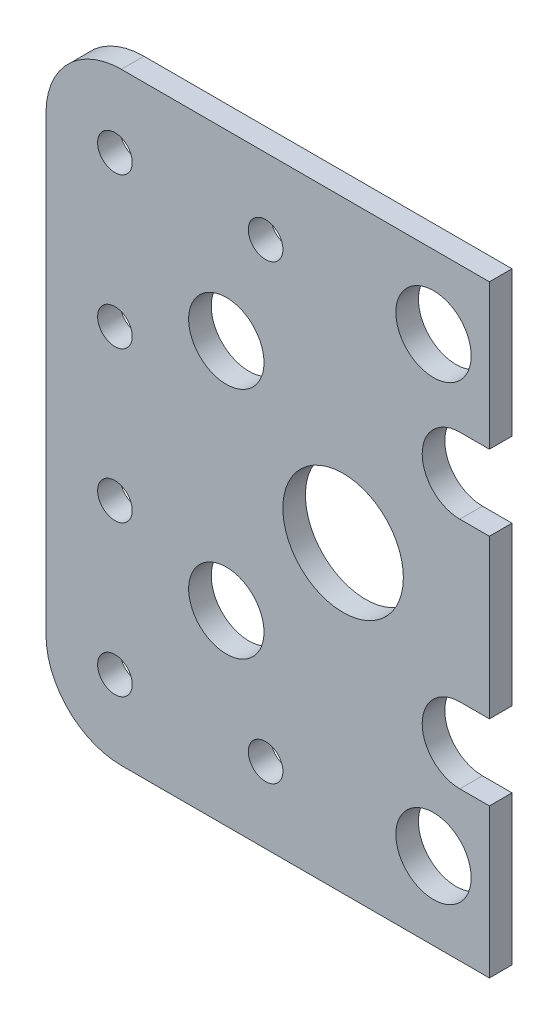
ISO-10303-21;
HEADER;
FILE_DESCRIPTION(('STEP AP214'),'2;1');
FILE_NAME('part.step','',(''),(''),'','','');
FILE_SCHEMA(('AUTOMOTIVE_DESIGN { 1 0 10303 214 1 1 1 1 }'));
ENDSEC;
DATA;
#1=APPLICATION_CONTEXT('core data for automotive mechanical design processes');
#2=APPLICATION_PROTOCOL_DEFINITION('international standard','automotive_design',2000,#1);
#3=PRODUCT_CONTEXT('',#1,'mechanical');
#4=PRODUCT('Part','Part','',(#3));
#5=PRODUCT_RELATED_PRODUCT_CATEGORY('part','',(#4));
#6=PRODUCT_DEFINITION_FORMATION('','',#4);
#7=PRODUCT_DEFINITION_CONTEXT('part definition',#1,'design');
#8=PRODUCT_DEFINITION('design','',#6,#7);
#9=PRODUCT_DEFINITION_SHAPE('','',#8);
#10=(LENGTH_UNIT() NAMED_UNIT(*) SI_UNIT(.MILLI.,.METRE.));
#11=(NAMED_UNIT(*) PLANE_ANGLE_UNIT() SI_UNIT($,.RADIAN.));
#12=(NAMED_UNIT(*) SI_UNIT($,.STERADIAN.) SOLID_ANGLE_UNIT());
#13=UNCERTAINTY_MEASURE_WITH_UNIT(LENGTH_MEASURE(1.E-05),#10,'distance_accuracy_value','');
#14=(GEOMETRIC_REPRESENTATION_CONTEXT(3) GLOBAL_UNCERTAINTY_ASSIGNED_CONTEXT((#13)) GLOBAL_UNIT_ASSIGNED_CONTEXT((#10,
#11,#12)) REPRESENTATION_CONTEXT('',''));
#15=CARTESIAN_POINT('',(0.,0.,0.));
#16=DIRECTION('',(0.,0.,1.));
#17=DIRECTION('',(1.,0.,0.));
#18=AXIS2_PLACEMENT_3D('',#15,#16,#17);
#19=CARTESIAN_POINT('',(116.52582366594,-141.896756478859,3.));
#20=DIRECTION('',(0.,0.,1.));
#21=DIRECTION('',(1.,0.,0.));
#22=AXIS2_PLACEMENT_3D('',#19,#20,#21);
#23=PLANE('',#22);
#24=CARTESIAN_POINT('',(157.960700719284,-141.591712302338,3.));
#25=DIRECTION('',(0.,0.,1.));
#26=DIRECTION('',(1.,0.,0.));
#27=AXIS2_PLACEMENT_3D('',#24,#25,#26);
#28=CIRCLE('',#27,4.99999999999999);
#29=CARTESIAN_POINT('',(162.960700719284,-141.591712302338,3.));
#30=VERTEX_POINT('',#29);
#31=EDGE_CURVE('E326',#30,#30,#28,.T.);
#32=ORIENTED_EDGE('',*,*,#31,.F.);
#33=EDGE_LOOP('',(#32));
#34=FACE_BOUND('',#33,.T.);
#35=CARTESIAN_POINT('',(130.460700719284,-127.114221830649,3.));
#36=DIRECTION('',(0.,0.,1.));
#37=DIRECTION('',(1.,0.,0.));
#38=AXIS2_PLACEMENT_3D('',#35,#36,#37);
#39=CIRCLE('',#38,4.99999999999988);
#40=CARTESIAN_POINT('',(135.460700719284,-127.114221830649,3.));
#41=VERTEX_POINT('',#40);
#42=EDGE_CURVE('E314',#41,#41,#39,.T.);
#43=ORIENTED_EDGE('',*,*,#42,.F.);
#44=EDGE_LOOP('',(#43));
#45=FACE_BOUND('',#44,.T.);
#46=CARTESIAN_POINT('',(115.674612815836,-141.866196007986,3.));
#47=DIRECTION('',(0.,0.,1.));
#48=DIRECTION('',(1.,0.,0.));
#49=AXIS2_PLACEMENT_3D('',#46,#47,#48);
#50=CIRCLE('',#49,2.30000000000001);
#51=CARTESIAN_POINT('',(117.974612815836,-141.866196007986,3.));
#52=VERTEX_POINT('',#51);
#53=EDGE_CURVE('E302',#52,#52,#50,.T.);
#54=ORIENTED_EDGE('',*,*,#53,.F.);
#55=EDGE_LOOP('',(#54));
#56=FACE_BOUND('',#55,.T.);
#57=CARTESIAN_POINT('',(135.674612815836,-81.8661960079857,3.));
#58=DIRECTION('',(0.,0.,1.));
#59=DIRECTION('',(1.,0.,0.));
#60=AXIS2_PLACEMENT_3D('',#57,#58,#59);
#61=CIRCLE('',#60,2.30000000000001);
#62=CARTESIAN_POINT('',(137.974612815836,-81.8661960079857,3.));
#63=VERTEX_POINT('',#62);
#64=EDGE_CURVE('E290',#63,#63,#61,.T.);
#65=ORIENTED_EDGE('',*,*,#64,.F.);
#66=EDGE_LOOP('',(#65));
#67=FACE_BOUND('',#66,.T.);
#68=CARTESIAN_POINT('',(115.674612815836,-121.866196007986,3.));
#69=DIRECTION('',(0.,0.,1.));
#70=DIRECTION('',(1.,0.,0.));
#71=AXIS2_PLACEMENT_3D('',#68,#69,#70);
#72=CIRCLE('',#71,2.30000000000001);
#73=CARTESIAN_POINT('',(117.974612815836,-121.866196007986,3.));
#74=VERTEX_POINT('',#73);
#75=EDGE_CURVE('E278',#74,#74,#72,.T.);
#76=ORIENTED_EDGE('',*,*,#75,.F.);
#77=EDGE_LOOP('',(#76));
#78=FACE_BOUND('',#77,.T.);
#79=DIRECTION('',(0.,1.,0.));
#80=VECTOR('',#79,1.);
#81=CARTESIAN_POINT('',(165.380720324349,-132.114221830649,3.));
#82=LINE('',#81,#80);
#83=CARTESIAN_POINT('',(165.380720324349,-151.896756478859,3.));
#84=VERTEX_POINT('',#83);
#85=CARTESIAN_POINT('',(165.380720324349,-132.114221830649,3.));
#86=VERTEX_POINT('',#85);
#87=EDGE_CURVE('E196',#84,#86,#82,.T.);
#88=ORIENTED_EDGE('',*,*,#87,.T.);
#89=DIRECTION('',(-1.,0.,0.));
#90=VECTOR('',#89,1.);
#91=CARTESIAN_POINT('',(161.460700719284,-132.114221830649,3.));
#92=LINE('',#91,#90);
#93=CARTESIAN_POINT('',(161.460700719284,-132.114221830649,3.));
#94=VERTEX_POINT('',#93);
#95=EDGE_CURVE('E109',#86,#94,#92,.T.);
#96=ORIENTED_EDGE('',*,*,#95,.T.);
#97=CARTESIAN_POINT('',(161.460700719284,-127.114221830649,3.));
#98=DIRECTION('',(0.,0.,-1.));
#99=DIRECTION('',(1.,0.,0.));
#100=AXIS2_PLACEMENT_3D('',#97,#98,#99);
#101=CIRCLE('',#100,5.00000000000002);
#102=CARTESIAN_POINT('',(161.460700719284,-122.114221830649,3.));
#103=VERTEX_POINT('',#102);
#104=EDGE_CURVE('E229',#94,#103,#101,.T.);
#105=ORIENTED_EDGE('',*,*,#104,.T.);
#106=DIRECTION('',(1.,0.,0.));
#107=VECTOR('',#106,1.);
#108=CARTESIAN_POINT('',(161.460700719284,-122.114221830649,3.));
#109=LINE('',#108,#107);
#110=CARTESIAN_POINT('',(165.380720324349,-122.114221830649,3.));
#111=VERTEX_POINT('',#110);
#112=EDGE_CURVE('E246',#103,#111,#109,.T.);
#113=ORIENTED_EDGE('',*,*,#112,.T.);
#114=DIRECTION('',(0.,1.,0.));
#115=VECTOR('',#114,1.);
#116=CARTESIAN_POINT('',(165.380720324349,-101.114221830649,3.));
#117=LINE('',#116,#115);
#118=CARTESIAN_POINT('',(165.380720324349,-101.114221830649,3.));
#119=VERTEX_POINT('',#118);
#120=EDGE_CURVE('E243',#111,#119,#117,.T.);
#121=ORIENTED_EDGE('',*,*,#120,.T.);
#122=DIRECTION('',(-1.,0.,0.));
#123=VECTOR('',#122,1.);
#124=CARTESIAN_POINT('',(161.460700719284,-101.114221830649,3.));
#125=LINE('',#124,#123);
#126=CARTESIAN_POINT('',(161.460700719284,-101.114221830649,3.));
#127=VERTEX_POINT('',#126);
#128=EDGE_CURVE('E245',#119,#127,#125,.T.);
#129=ORIENTED_EDGE('',*,*,#128,.T.);
#130=CARTESIAN_POINT('',(161.460700719284,-96.1142218306485,3.));
#131=DIRECTION('',(0.,0.,-1.));
#132=DIRECTION('',(1.,0.,0.));
#133=AXIS2_PLACEMENT_3D('',#130,#131,#132);
#134=CIRCLE('',#133,4.99999999999999);
#135=CARTESIAN_POINT('',(161.460700719284,-91.1142218306486,3.));
#136=VERTEX_POINT('',#135);
#137=EDGE_CURVE('E248',#127,#136,#134,.T.);
#138=ORIENTED_EDGE('',*,*,#137,.T.);
#139=DIRECTION('',(1.,0.,0.));
#140=VECTOR('',#139,1.);
#141=CARTESIAN_POINT('',(161.460700719284,-91.1142218306486,3.));
#142=LINE('',#141,#140);
#143=CARTESIAN_POINT('',(165.380720324349,-91.1142218306486,3.));
#144=VERTEX_POINT('',#143);
#145=EDGE_CURVE('E254',#136,#144,#142,.T.);
#146=ORIENTED_EDGE('',*,*,#145,.T.);
#147=DIRECTION('',(0.,1.,0.));
#148=VECTOR('',#147,1.);
#149=CARTESIAN_POINT('',(165.380720324349,-71.8661960079857,3.));
#150=LINE('',#149,#148);
#151=CARTESIAN_POINT('',(165.380720324349,-71.8661960079857,3.));
#152=VERTEX_POINT('',#151);
#153=EDGE_CURVE('E256',#144,#152,#150,.T.);
#154=ORIENTED_EDGE('',*,*,#153,.T.);
#155=DIRECTION('',(-1.,0.,0.));
#156=VECTOR('',#155,1.);
#157=CARTESIAN_POINT('',(157.960700719284,-71.8661960079857,3.));
#158=LINE('',#157,#156);
#159=CARTESIAN_POINT('',(116.52582366594,-71.8661960079857,3.));
#160=VERTEX_POINT('',#159);
#161=EDGE_CURVE('E258',#152,#160,#158,.T.);
#162=ORIENTED_EDGE('',*,*,#161,.T.);
#163=CARTESIAN_POINT('',(116.52582366594,-81.8661960079857,3.));
#164=DIRECTION('',(0.,0.,1.));
#165=DIRECTION('',(1.,0.,0.));
#166=AXIS2_PLACEMENT_3D('',#163,#164,#165);
#167=CIRCLE('',#166,9.99999999999999);
#168=CARTESIAN_POINT('',(106.52582366594,-81.8661960079857,3.));
#169=VERTEX_POINT('',#168);
#170=EDGE_CURVE('E147',#160,#169,#167,.T.);
#171=ORIENTED_EDGE('',*,*,#170,.T.);
#172=DIRECTION('',(0.,-1.,0.));
#173=VECTOR('',#172,1.);
#174=CARTESIAN_POINT('',(106.52582366594,-81.8661960079857,3.));
#175=LINE('',#174,#173);
#176=CARTESIAN_POINT('',(106.52582366594,-141.896756478859,3.));
#177=VERTEX_POINT('',#176);
#178=EDGE_CURVE('E140',#169,#177,#175,.T.);
#179=ORIENTED_EDGE('',*,*,#178,.T.);
#180=CARTESIAN_POINT('',(116.52582366594,-141.896756478859,3.));
#181=DIRECTION('',(0.,0.,1.));
#182=DIRECTION('',(1.,0.,0.));
#183=AXIS2_PLACEMENT_3D('',#180,#181,#182);
#184=CIRCLE('',#183,9.99999999999999);
#185=CARTESIAN_POINT('',(116.52582366594,-151.896756478859,3.));
#186=VERTEX_POINT('',#185);
#187=EDGE_CURVE('E144',#177,#186,#184,.T.);
#188=ORIENTED_EDGE('',*,*,#187,.T.);
#189=DIRECTION('',(1.,0.,0.));
#190=VECTOR('',#189,1.);
#191=CARTESIAN_POINT('',(116.52582366594,-151.896756478859,3.));
#192=LINE('',#191,#190);
#193=EDGE_CURVE('E50',#186,#84,#192,.T.);
#194=ORIENTED_EDGE('',*,*,#193,.T.);
#195=EDGE_LOOP('',(#88,#96,#105,#113,#121,#129,#138,#146,#154,#162,#171,#179,#188,#194));
#196=FACE_BOUND('',#195,.T.);
#197=CARTESIAN_POINT('',(115.674612815836,-101.866196007986,3.));
#198=DIRECTION('',(0.,0.,1.));
#199=DIRECTION('',(1.,0.,0.));
#200=AXIS2_PLACEMENT_3D('',#197,#198,#199);
#201=CIRCLE('',#200,2.29999999999999);
#202=CARTESIAN_POINT('',(117.974612815836,-101.866196007986,3.));
#203=VERTEX_POINT('',#202);
#204=EDGE_CURVE('E171',#203,#203,#201,.T.);
#205=ORIENTED_EDGE('',*,*,#204,.F.);
#206=EDGE_LOOP('',(#205));
#207=FACE_BOUND('',#206,.T.);
#208=CARTESIAN_POINT('',(135.674612815836,-141.866196007986,3.));
#209=DIRECTION('',(0.,0.,1.));
#210=DIRECTION('',(1.,0.,0.));
#211=AXIS2_PLACEMENT_3D('',#208,#209,#210);
#212=CIRCLE('',#211,2.30000000000001);
#213=CARTESIAN_POINT('',(137.974612815836,-141.866196007986,3.));
#214=VERTEX_POINT('',#213);
#215=EDGE_CURVE('E284',#214,#214,#212,.T.);
#216=ORIENTED_EDGE('',*,*,#215,.F.);
#217=EDGE_LOOP('',(#216));
#218=FACE_BOUND('',#217,.T.);
#219=CARTESIAN_POINT('',(115.674612815836,-81.8661960079857,3.));
#220=DIRECTION('',(0.,0.,1.));
#221=DIRECTION('',(1.,0.,0.));
#222=AXIS2_PLACEMENT_3D('',#219,#220,#221);
#223=CIRCLE('',#222,2.29999999999999);
#224=CARTESIAN_POINT('',(117.974612815836,-81.8661960079857,3.));
#225=VERTEX_POINT('',#224);
#226=EDGE_CURVE('E296',#225,#225,#223,.T.);
#227=ORIENTED_EDGE('',*,*,#226,.F.);
#228=EDGE_LOOP('',(#227));
#229=FACE_BOUND('',#228,.T.);
#230=CARTESIAN_POINT('',(130.460700719284,-96.1142218306485,3.));
#231=DIRECTION('',(0.,0.,1.));
#232=DIRECTION('',(1.,0.,0.));
#233=AXIS2_PLACEMENT_3D('',#230,#231,#232);
#234=CIRCLE('',#233,4.9999999999999);
#235=CARTESIAN_POINT('',(135.460700719284,-96.1142218306485,3.));
#236=VERTEX_POINT('',#235);
#237=EDGE_CURVE('E308',#236,#236,#234,.T.);
#238=ORIENTED_EDGE('',*,*,#237,.F.);
#239=EDGE_LOOP('',(#238));
#240=FACE_BOUND('',#239,.T.);
#241=CARTESIAN_POINT('',(145.960700719284,-111.591712302338,3.));
#242=DIRECTION('',(0.,0.,1.));
#243=DIRECTION('',(1.,0.,0.));
#244=AXIS2_PLACEMENT_3D('',#241,#242,#243);
#245=CIRCLE('',#244,8.00000000000001);
#246=CARTESIAN_POINT('',(153.960700719284,-111.591712302338,3.));
#247=VERTEX_POINT('',#246);
#248=EDGE_CURVE('E320',#247,#247,#245,.T.);
#249=ORIENTED_EDGE('',*,*,#248,.F.);
#250=EDGE_LOOP('',(#249));
#251=FACE_BOUND('',#250,.T.);
#252=CARTESIAN_POINT('',(157.960700719284,-81.5917123023381,3.));
#253=DIRECTION('',(0.,0.,1.));
#254=DIRECTION('',(1.,0.,0.));
#255=AXIS2_PLACEMENT_3D('',#252,#253,#254);
#256=CIRCLE('',#255,5.00000000000002);
#257=CARTESIAN_POINT('',(162.960700719284,-81.5917123023381,3.));
#258=VERTEX_POINT('',#257);
#259=EDGE_CURVE('E332',#258,#258,#256,.T.);
#260=ORIENTED_EDGE('',*,*,#259,.F.);
#261=EDGE_LOOP('',(#260));
#262=FACE_BOUND('',#261,.T.);
#263=ADVANCED_FACE('F33',(#34,#45,#56,#67,#78,#196,#207,#218,#229,#240,#251,#262),#23,.T.);
#264=CARTESIAN_POINT('',(116.52582366594,-141.896756478859,0.));
#265=DIRECTION('',(0.,0.,1.));
#266=DIRECTION('',(1.,0.,0.));
#267=AXIS2_PLACEMENT_3D('',#264,#265,#266);
#268=PLANE('',#267);
#269=DIRECTION('',(0.,1.,0.));
#270=VECTOR('',#269,1.);
#271=CARTESIAN_POINT('',(165.380720324349,-132.114221830649,0.));
#272=LINE('',#271,#270);
#273=CARTESIAN_POINT('',(165.380720324349,-151.896756478859,0.));
#274=VERTEX_POINT('',#273);
#275=CARTESIAN_POINT('',(165.380720324349,-132.114221830649,0.));
#276=VERTEX_POINT('',#275);
#277=EDGE_CURVE('E167',#274,#276,#272,.T.);
#278=ORIENTED_EDGE('',*,*,#277,.F.);
#279=DIRECTION('',(1.,0.,0.));
#280=VECTOR('',#279,1.);
#281=CARTESIAN_POINT('',(165.380720324349,-151.896756478859,0.));
#282=LINE('',#281,#280);
#283=CARTESIAN_POINT('',(116.52582366594,-151.896756478859,0.));
#284=VERTEX_POINT('',#283);
#285=EDGE_CURVE('E97',#284,#274,#282,.T.);
#286=ORIENTED_EDGE('',*,*,#285,.F.);
#287=CARTESIAN_POINT('',(116.52582366594,-141.896756478859,0.));
#288=DIRECTION('',(0.,0.,1.));
#289=DIRECTION('',(1.,0.,0.));
#290=AXIS2_PLACEMENT_3D('',#287,#288,#289);
#291=CIRCLE('',#290,9.99999999999999);
#292=CARTESIAN_POINT('',(106.52582366594,-141.896756478859,0.));
#293=VERTEX_POINT('',#292);
#294=EDGE_CURVE('E193',#293,#284,#291,.T.);
#295=ORIENTED_EDGE('',*,*,#294,.F.);
#296=DIRECTION('',(0.,-1.,0.));
#297=VECTOR('',#296,1.);
#298=CARTESIAN_POINT('',(106.52582366594,-81.8661960079857,0.));
#299=LINE('',#298,#297);
#300=CARTESIAN_POINT('',(106.52582366594,-81.8661960079857,0.));
#301=VERTEX_POINT('',#300);
#302=EDGE_CURVE('E156',#301,#293,#299,.T.);
#303=ORIENTED_EDGE('',*,*,#302,.F.);
#304=CARTESIAN_POINT('',(116.52582366594,-81.8661960079857,0.));
#305=DIRECTION('',(0.,0.,1.));
#306=DIRECTION('',(1.,0.,0.));
#307=AXIS2_PLACEMENT_3D('',#304,#305,#306);
#308=CIRCLE('',#307,9.99999999999999);
#309=CARTESIAN_POINT('',(116.52582366594,-71.8661960079857,0.));
#310=VERTEX_POINT('',#309);
#311=EDGE_CURVE('E190',#310,#301,#308,.T.);
#312=ORIENTED_EDGE('',*,*,#311,.F.);
#313=DIRECTION('',(-1.,0.,0.));
#314=VECTOR('',#313,1.);
#315=CARTESIAN_POINT('',(116.52582366594,-71.8661960079857,0.));
#316=LINE('',#315,#314);
#317=CARTESIAN_POINT('',(165.380720324349,-71.8661960079857,0.));
#318=VERTEX_POINT('',#317);
#319=EDGE_CURVE('E188',#318,#310,#316,.T.);
#320=ORIENTED_EDGE('',*,*,#319,.F.);
#321=DIRECTION('',(0.,1.,0.));
#322=VECTOR('',#321,1.);
#323=CARTESIAN_POINT('',(165.380720324349,-71.8661960079857,0.));
#324=LINE('',#323,#322);
#325=CARTESIAN_POINT('',(165.380720324349,-91.1142218306486,0.));
#326=VERTEX_POINT('',#325);
#327=EDGE_CURVE('E185',#326,#318,#324,.T.);
#328=ORIENTED_EDGE('',*,*,#327,.F.);
#329=DIRECTION('',(1.,0.,0.));
#330=VECTOR('',#329,1.);
#331=CARTESIAN_POINT('',(161.460700719284,-91.1142218306486,0.));
#332=LINE('',#331,#330);
#333=CARTESIAN_POINT('',(161.460700719284,-91.1142218306486,0.));
#334=VERTEX_POINT('',#333);
#335=EDGE_CURVE('E183',#334,#326,#332,.T.);
#336=ORIENTED_EDGE('',*,*,#335,.F.);
#337=CARTESIAN_POINT('',(161.460700719284,-96.1142218306485,0.));
#338=DIRECTION('',(0.,0.,-1.));
#339=DIRECTION('',(1.,0.,0.));
#340=AXIS2_PLACEMENT_3D('',#337,#338,#339);
#341=CIRCLE('',#340,4.99999999999999);
#342=CARTESIAN_POINT('',(161.460700719284,-101.114221830649,0.));
#343=VERTEX_POINT('',#342);
#344=EDGE_CURVE('E181',#343,#334,#341,.T.);
#345=ORIENTED_EDGE('',*,*,#344,.F.);
#346=DIRECTION('',(-1.,0.,0.));
#347=VECTOR('',#346,1.);
#348=CARTESIAN_POINT('',(161.460700719284,-101.114221830649,0.));
#349=LINE('',#348,#347);
#350=CARTESIAN_POINT('',(165.380720324349,-101.114221830649,0.));
#351=VERTEX_POINT('',#350);
#352=EDGE_CURVE('E179',#351,#343,#349,.T.);
#353=ORIENTED_EDGE('',*,*,#352,.F.);
#354=DIRECTION('',(0.,1.,0.));
#355=VECTOR('',#354,1.);
#356=CARTESIAN_POINT('',(165.380720324349,-101.114221830649,0.));
#357=LINE('',#356,#355);
#358=CARTESIAN_POINT('',(165.380720324349,-122.114221830649,0.));
#359=VERTEX_POINT('',#358);
#360=EDGE_CURVE('E177',#359,#351,#357,.T.);
#361=ORIENTED_EDGE('',*,*,#360,.F.);
#362=DIRECTION('',(1.,0.,0.));
#363=VECTOR('',#362,1.);
#364=CARTESIAN_POINT('',(161.460700719284,-122.114221830649,0.));
#365=LINE('',#364,#363);
#366=CARTESIAN_POINT('',(161.460700719284,-122.114221830649,0.));
#367=VERTEX_POINT('',#366);
#368=EDGE_CURVE('E175',#367,#359,#365,.T.);
#369=ORIENTED_EDGE('',*,*,#368,.F.);
#370=CARTESIAN_POINT('',(161.460700719284,-127.114221830649,0.));
#371=DIRECTION('',(0.,0.,-1.));
#372=DIRECTION('',(1.,0.,0.));
#373=AXIS2_PLACEMENT_3D('',#370,#371,#372);
#374=CIRCLE('',#373,5.00000000000002);
#375=CARTESIAN_POINT('',(161.460700719284,-132.114221830649,0.));
#376=VERTEX_POINT('',#375);
#377=EDGE_CURVE('E173',#376,#367,#374,.T.);
#378=ORIENTED_EDGE('',*,*,#377,.F.);
#379=DIRECTION('',(-1.,0.,0.));
#380=VECTOR('',#379,1.);
#381=CARTESIAN_POINT('',(161.460700719284,-132.114221830649,0.));
#382=LINE('',#381,#380);
#383=EDGE_CURVE('E170',#276,#376,#382,.T.);
#384=ORIENTED_EDGE('',*,*,#383,.F.);
#385=EDGE_LOOP('',(#278,#286,#295,#303,#312,#320,#328,#336,#345,#353,#361,#369,#378,#384));
#386=FACE_BOUND('',#385,.T.);
#387=CARTESIAN_POINT('',(115.674612815836,-101.866196007986,0.));
#388=DIRECTION('',(0.,0.,1.));
#389=DIRECTION('',(1.,0.,0.));
#390=AXIS2_PLACEMENT_3D('',#387,#388,#389);
#391=CIRCLE('',#390,2.29999999999999);
#392=CARTESIAN_POINT('',(117.974612815836,-101.866196007986,0.));
#393=VERTEX_POINT('',#392);
#394=EDGE_CURVE('E275',#393,#393,#391,.T.);
#395=ORIENTED_EDGE('',*,*,#394,.T.);
#396=EDGE_LOOP('',(#395));
#397=FACE_BOUND('',#396,.T.);
#398=CARTESIAN_POINT('',(115.674612815836,-121.866196007986,0.));
#399=DIRECTION('',(0.,0.,1.));
#400=DIRECTION('',(1.,0.,0.));
#401=AXIS2_PLACEMENT_3D('',#398,#399,#400);
#402=CIRCLE('',#401,2.30000000000001);
#403=CARTESIAN_POINT('',(117.974612815836,-121.866196007986,0.));
#404=VERTEX_POINT('',#403);
#405=EDGE_CURVE('E281',#404,#404,#402,.T.);
#406=ORIENTED_EDGE('',*,*,#405,.T.);
#407=EDGE_LOOP('',(#406));
#408=FACE_BOUND('',#407,.T.);
#409=CARTESIAN_POINT('',(135.674612815836,-141.866196007986,0.));
#410=DIRECTION('',(0.,0.,1.));
#411=DIRECTION('',(1.,0.,0.));
#412=AXIS2_PLACEMENT_3D('',#409,#410,#411);
#413=CIRCLE('',#412,2.30000000000001);
#414=CARTESIAN_POINT('',(137.974612815836,-141.866196007986,0.));
#415=VERTEX_POINT('',#414);
#416=EDGE_CURVE('E287',#415,#415,#413,.T.);
#417=ORIENTED_EDGE('',*,*,#416,.T.);
#418=EDGE_LOOP('',(#417));
#419=FACE_BOUND('',#418,.T.);
#420=CARTESIAN_POINT('',(135.674612815836,-81.8661960079857,0.));
#421=DIRECTION('',(0.,0.,1.));
#422=DIRECTION('',(1.,0.,0.));
#423=AXIS2_PLACEMENT_3D('',#420,#421,#422);
#424=CIRCLE('',#423,2.30000000000001);
#425=CARTESIAN_POINT('',(137.974612815836,-81.8661960079857,0.));
#426=VERTEX_POINT('',#425);
#427=EDGE_CURVE('E293',#426,#426,#424,.T.);
#428=ORIENTED_EDGE('',*,*,#427,.T.);
#429=EDGE_LOOP('',(#428));
#430=FACE_BOUND('',#429,.T.);
#431=CARTESIAN_POINT('',(115.674612815836,-81.8661960079857,0.));
#432=DIRECTION('',(0.,0.,1.));
#433=DIRECTION('',(1.,0.,0.));
#434=AXIS2_PLACEMENT_3D('',#431,#432,#433);
#435=CIRCLE('',#434,2.29999999999999);
#436=CARTESIAN_POINT('',(117.974612815836,-81.8661960079857,0.));
#437=VERTEX_POINT('',#436);
#438=EDGE_CURVE('E299',#437,#437,#435,.T.);
#439=ORIENTED_EDGE('',*,*,#438,.T.);
#440=EDGE_LOOP('',(#439));
#441=FACE_BOUND('',#440,.T.);
#442=CARTESIAN_POINT('',(115.674612815836,-141.866196007986,0.));
#443=DIRECTION('',(0.,0.,1.));
#444=DIRECTION('',(1.,0.,0.));
#445=AXIS2_PLACEMENT_3D('',#442,#443,#444);
#446=CIRCLE('',#445,2.30000000000001);
#447=CARTESIAN_POINT('',(117.974612815836,-141.866196007986,0.));
#448=VERTEX_POINT('',#447);
#449=EDGE_CURVE('E305',#448,#448,#446,.T.);
#450=ORIENTED_EDGE('',*,*,#449,.T.);
#451=EDGE_LOOP('',(#450));
#452=FACE_BOUND('',#451,.T.);
#453=CARTESIAN_POINT('',(130.460700719284,-96.1142218306485,0.));
#454=DIRECTION('',(0.,0.,1.));
#455=DIRECTION('',(1.,0.,0.));
#456=AXIS2_PLACEMENT_3D('',#453,#454,#455);
#457=CIRCLE('',#456,4.9999999999999);
#458=CARTESIAN_POINT('',(135.460700719284,-96.1142218306485,0.));
#459=VERTEX_POINT('',#458);
#460=EDGE_CURVE('E311',#459,#459,#457,.T.);
#461=ORIENTED_EDGE('',*,*,#460,.T.);
#462=EDGE_LOOP('',(#461));
#463=FACE_BOUND('',#462,.T.);
#464=CARTESIAN_POINT('',(130.460700719284,-127.114221830649,0.));
#465=DIRECTION('',(0.,0.,1.));
#466=DIRECTION('',(1.,0.,0.));
#467=AXIS2_PLACEMENT_3D('',#464,#465,#466);
#468=CIRCLE('',#467,4.99999999999988);
#469=CARTESIAN_POINT('',(135.460700719284,-127.114221830649,0.));
#470=VERTEX_POINT('',#469);
#471=EDGE_CURVE('E317',#470,#470,#468,.T.);
#472=ORIENTED_EDGE('',*,*,#471,.T.);
#473=EDGE_LOOP('',(#472));
#474=FACE_BOUND('',#473,.T.);
#475=CARTESIAN_POINT('',(145.960700719284,-111.591712302338,0.));
#476=DIRECTION('',(0.,0.,1.));
#477=DIRECTION('',(1.,0.,0.));
#478=AXIS2_PLACEMENT_3D('',#475,#476,#477);
#479=CIRCLE('',#478,8.00000000000001);
#480=CARTESIAN_POINT('',(153.960700719284,-111.591712302338,0.));
#481=VERTEX_POINT('',#480);
#482=EDGE_CURVE('E323',#481,#481,#479,.T.);
#483=ORIENTED_EDGE('',*,*,#482,.T.);
#484=EDGE_LOOP('',(#483));
#485=FACE_BOUND('',#484,.T.);
#486=CARTESIAN_POINT('',(157.960700719284,-141.591712302338,0.));
#487=DIRECTION('',(0.,0.,1.));
#488=DIRECTION('',(1.,0.,0.));
#489=AXIS2_PLACEMENT_3D('',#486,#487,#488);
#490=CIRCLE('',#489,4.99999999999999);
#491=CARTESIAN_POINT('',(162.960700719284,-141.591712302338,0.));
#492=VERTEX_POINT('',#491);
#493=EDGE_CURVE('E329',#492,#492,#490,.T.);
#494=ORIENTED_EDGE('',*,*,#493,.T.);
#495=EDGE_LOOP('',(#494));
#496=FACE_BOUND('',#495,.T.);
#497=CARTESIAN_POINT('',(157.960700719284,-81.5917123023381,0.));
#498=DIRECTION('',(0.,0.,1.));
#499=DIRECTION('',(1.,0.,0.));
#500=AXIS2_PLACEMENT_3D('',#497,#498,#499);
#501=CIRCLE('',#500,5.00000000000002);
#502=CARTESIAN_POINT('',(162.960700719284,-81.5917123023381,0.));
#503=VERTEX_POINT('',#502);
#504=EDGE_CURVE('E335',#503,#503,#501,.T.);
#505=ORIENTED_EDGE('',*,*,#504,.T.);
#506=EDGE_LOOP('',(#505));
#507=FACE_BOUND('',#506,.T.);
#508=ADVANCED_FACE('F231',(#386,#397,#408,#419,#430,#441,#452,#463,#474,#485,#496,#507),#268,.F.);
#509=CARTESIAN_POINT('',(165.380720324349,-132.114221830649,3.));
#510=DIRECTION('',(-1.,0.,0.));
#511=DIRECTION('',(0.,0.,1.));
#512=AXIS2_PLACEMENT_3D('',#509,#510,#511);
#513=PLANE('',#512);
#514=ORIENTED_EDGE('',*,*,#277,.T.);
#515=DIRECTION('',(0.,0.,-1.));
#516=VECTOR('',#515,1.);
#517=CARTESIAN_POINT('',(165.380720324349,-132.114221830649,3.));
#518=LINE('',#517,#516);
#519=EDGE_CURVE('E11',#86,#276,#518,.T.);
#520=ORIENTED_EDGE('',*,*,#519,.F.);
#521=ORIENTED_EDGE('',*,*,#87,.F.);
#522=DIRECTION('',(0.,0.,-1.));
#523=VECTOR('',#522,1.);
#524=CARTESIAN_POINT('',(165.380720324349,-151.896756478859,3.));
#525=LINE('',#524,#523);
#526=EDGE_CURVE('E163',#84,#274,#525,.T.);
#527=ORIENTED_EDGE('',*,*,#526,.T.);
#528=EDGE_LOOP('',(#514,#520,#521,#527));
#529=FACE_BOUND('',#528,.T.);
#530=ADVANCED_FACE('F35',(#529),#513,.F.);
#531=CARTESIAN_POINT('',(161.460700719284,-132.114221830649,3.));
#532=DIRECTION('',(0.,-1.,0.));
#533=DIRECTION('',(0.,0.,-1.));
#534=AXIS2_PLACEMENT_3D('',#531,#532,#533);
#535=PLANE('',#534);
#536=ORIENTED_EDGE('',*,*,#383,.T.);
#537=DIRECTION('',(0.,0.,-1.));
#538=VECTOR('',#537,1.);
#539=CARTESIAN_POINT('',(161.460700719284,-132.114221830649,3.));
#540=LINE('',#539,#538);
#541=EDGE_CURVE('E42',#94,#376,#540,.T.);
#542=ORIENTED_EDGE('',*,*,#541,.F.);
#543=ORIENTED_EDGE('',*,*,#95,.F.);
#544=ORIENTED_EDGE('',*,*,#519,.T.);
#545=EDGE_LOOP('',(#536,#542,#543,#544));
#546=FACE_BOUND('',#545,.T.);
#547=ADVANCED_FACE('F388',(#546),#535,.F.);
#548=CARTESIAN_POINT('',(161.460700719284,-127.114221830649,3.));
#549=DIRECTION('',(0.,0.,-1.));
#550=DIRECTION('',(-1.,0.,0.));
#551=AXIS2_PLACEMENT_3D('',#548,#549,#550);
#552=CYLINDRICAL_SURFACE('',#551,5.00000000000002);
#553=ORIENTED_EDGE('',*,*,#377,.T.);
#554=DIRECTION('',(0.,0.,-1.));
#555=VECTOR('',#554,1.);
#556=CARTESIAN_POINT('',(161.460700719284,-122.114221830649,3.));
#557=LINE('',#556,#555);
#558=EDGE_CURVE('E221',#103,#367,#557,.T.);
#559=ORIENTED_EDGE('',*,*,#558,.F.);
#560=ORIENTED_EDGE('',*,*,#104,.F.);
#561=ORIENTED_EDGE('',*,*,#541,.T.);
#562=EDGE_LOOP('',(#553,#559,#560,#561));
#563=FACE_BOUND('',#562,.T.);
#564=ADVANCED_FACE('F227',(#563),#552,.F.);
#565=CARTESIAN_POINT('',(161.460700719284,-122.114221830649,3.));
#566=DIRECTION('',(0.,1.,0.));
#567=DIRECTION('',(0.,0.,1.));
#568=AXIS2_PLACEMENT_3D('',#565,#566,#567);
#569=PLANE('',#568);
#570=ORIENTED_EDGE('',*,*,#368,.T.);
#571=DIRECTION('',(0.,0.,-1.));
#572=VECTOR('',#571,1.);
#573=CARTESIAN_POINT('',(165.380720324349,-122.114221830649,3.));
#574=LINE('',#573,#572);
#575=EDGE_CURVE('E218',#111,#359,#574,.T.);
#576=ORIENTED_EDGE('',*,*,#575,.F.);
#577=ORIENTED_EDGE('',*,*,#112,.F.);
#578=ORIENTED_EDGE('',*,*,#558,.T.);
#579=EDGE_LOOP('',(#570,#576,#577,#578));
#580=FACE_BOUND('',#579,.T.);
#581=ADVANCED_FACE('F237',(#580),#569,.F.);
#582=CARTESIAN_POINT('',(165.380720324349,-101.114221830649,3.));
#583=DIRECTION('',(-1.,0.,0.));
#584=DIRECTION('',(0.,0.,1.));
#585=AXIS2_PLACEMENT_3D('',#582,#583,#584);
#586=PLANE('',#585);
#587=ORIENTED_EDGE('',*,*,#360,.T.);
#588=DIRECTION('',(0.,0.,-1.));
#589=VECTOR('',#588,1.);
#590=CARTESIAN_POINT('',(165.380720324349,-101.114221830649,3.));
#591=LINE('',#590,#589);
#592=EDGE_CURVE('E215',#119,#351,#591,.T.);
#593=ORIENTED_EDGE('',*,*,#592,.F.);
#594=ORIENTED_EDGE('',*,*,#120,.F.);
#595=ORIENTED_EDGE('',*,*,#575,.T.);
#596=EDGE_LOOP('',(#587,#593,#594,#595));
#597=FACE_BOUND('',#596,.T.);
#598=ADVANCED_FACE('F241',(#597),#586,.F.);
#599=CARTESIAN_POINT('',(161.460700719284,-101.114221830649,3.));
#600=DIRECTION('',(0.,-1.,0.));
#601=DIRECTION('',(0.,0.,-1.));
#602=AXIS2_PLACEMENT_3D('',#599,#600,#601);
#603=PLANE('',#602);
#604=ORIENTED_EDGE('',*,*,#352,.T.);
#605=DIRECTION('',(0.,0.,-1.));
#606=VECTOR('',#605,1.);
#607=CARTESIAN_POINT('',(161.460700719284,-101.114221830649,3.));
#608=LINE('',#607,#606);
#609=EDGE_CURVE('E212',#127,#343,#608,.T.);
#610=ORIENTED_EDGE('',*,*,#609,.F.);
#611=ORIENTED_EDGE('',*,*,#128,.F.);
#612=ORIENTED_EDGE('',*,*,#592,.T.);
#613=EDGE_LOOP('',(#604,#610,#611,#612));
#614=FACE_BOUND('',#613,.T.);
#615=ADVANCED_FACE('F378',(#614),#603,.F.);
#616=CARTESIAN_POINT('',(161.460700719284,-96.1142218306485,3.));
#617=DIRECTION('',(0.,0.,-1.));
#618=DIRECTION('',(-1.,0.,0.));
#619=AXIS2_PLACEMENT_3D('',#616,#617,#618);
#620=CYLINDRICAL_SURFACE('',#619,4.99999999999999);
#621=ORIENTED_EDGE('',*,*,#344,.T.);
#622=DIRECTION('',(0.,0.,-1.));
#623=VECTOR('',#622,1.);
#624=CARTESIAN_POINT('',(161.460700719284,-91.1142218306486,3.));
#625=LINE('',#624,#623);
#626=EDGE_CURVE('E209',#136,#334,#625,.T.);
#627=ORIENTED_EDGE('',*,*,#626,.F.);
#628=ORIENTED_EDGE('',*,*,#137,.F.);
#629=ORIENTED_EDGE('',*,*,#609,.T.);
#630=EDGE_LOOP('',(#621,#627,#628,#629));
#631=FACE_BOUND('',#630,.T.);
#632=ADVANCED_FACE('F374',(#631),#620,.F.);
#633=CARTESIAN_POINT('',(161.460700719284,-91.1142218306486,3.));
#634=DIRECTION('',(0.,1.,0.));
#635=DIRECTION('',(0.,0.,1.));
#636=AXIS2_PLACEMENT_3D('',#633,#634,#635);
#637=PLANE('',#636);
#638=ORIENTED_EDGE('',*,*,#335,.T.);
#639=DIRECTION('',(0.,0.,-1.));
#640=VECTOR('',#639,1.);
#641=CARTESIAN_POINT('',(165.380720324349,-91.1142218306486,3.));
#642=LINE('',#641,#640);
#643=EDGE_CURVE('E206',#144,#326,#642,.T.);
#644=ORIENTED_EDGE('',*,*,#643,.F.);
#645=ORIENTED_EDGE('',*,*,#145,.F.);
#646=ORIENTED_EDGE('',*,*,#626,.T.);
#647=EDGE_LOOP('',(#638,#644,#645,#646));
#648=FACE_BOUND('',#647,.T.);
#649=ADVANCED_FACE('F370',(#648),#637,.F.);
#650=CARTESIAN_POINT('',(165.380720324349,-71.8661960079857,3.));
#651=DIRECTION('',(-1.,0.,0.));
#652=DIRECTION('',(0.,0.,1.));
#653=AXIS2_PLACEMENT_3D('',#650,#651,#652);
#654=PLANE('',#653);
#655=ORIENTED_EDGE('',*,*,#327,.T.);
#656=DIRECTION('',(0.,0.,-1.));
#657=VECTOR('',#656,1.);
#658=CARTESIAN_POINT('',(165.380720324349,-71.8661960079857,3.));
#659=LINE('',#658,#657);
#660=EDGE_CURVE('E203',#152,#318,#659,.T.);
#661=ORIENTED_EDGE('',*,*,#660,.F.);
#662=ORIENTED_EDGE('',*,*,#153,.F.);
#663=ORIENTED_EDGE('',*,*,#643,.T.);
#664=EDGE_LOOP('',(#655,#661,#662,#663));
#665=FACE_BOUND('',#664,.T.);
#666=ADVANCED_FACE('F367',(#665),#654,.F.);
#667=CARTESIAN_POINT('',(116.52582366594,-71.8661960079857,3.));
#668=DIRECTION('',(0.,-1.,0.));
#669=DIRECTION('',(0.,0.,-1.));
#670=AXIS2_PLACEMENT_3D('',#667,#668,#669);
#671=PLANE('',#670);
#672=ORIENTED_EDGE('',*,*,#319,.T.);
#673=DIRECTION('',(0.,0.,-1.));
#674=VECTOR('',#673,1.);
#675=CARTESIAN_POINT('',(116.52582366594,-71.8661960079857,3.));
#676=LINE('',#675,#674);
#677=EDGE_CURVE('E200',#160,#310,#676,.T.);
#678=ORIENTED_EDGE('',*,*,#677,.F.);
#679=ORIENTED_EDGE('',*,*,#161,.F.);
#680=ORIENTED_EDGE('',*,*,#660,.T.);
#681=EDGE_LOOP('',(#672,#678,#679,#680));
#682=FACE_BOUND('',#681,.T.);
#683=ADVANCED_FACE('F264',(#682),#671,.F.);
#684=CARTESIAN_POINT('',(116.52582366594,-81.8661960079857,3.));
#685=DIRECTION('',(0.,0.,-1.));
#686=DIRECTION('',(-1.,0.,0.));
#687=AXIS2_PLACEMENT_3D('',#684,#685,#686);
#688=CYLINDRICAL_SURFACE('',#687,9.99999999999999);
#689=ORIENTED_EDGE('',*,*,#311,.T.);
#690=DIRECTION('',(0.,0.,-1.));
#691=VECTOR('',#690,1.);
#692=CARTESIAN_POINT('',(106.52582366594,-81.8661960079857,3.));
#693=LINE('',#692,#691);
#694=EDGE_CURVE('E158',#169,#301,#693,.T.);
#695=ORIENTED_EDGE('',*,*,#694,.F.);
#696=ORIENTED_EDGE('',*,*,#170,.F.);
#697=ORIENTED_EDGE('',*,*,#677,.T.);
#698=EDGE_LOOP('',(#689,#695,#696,#697));
#699=FACE_BOUND('',#698,.T.);
#700=ADVANCED_FACE('F267',(#699),#688,.T.);
#701=CARTESIAN_POINT('',(106.52582366594,-81.8661960079857,3.));
#702=DIRECTION('',(1.,0.,0.));
#703=DIRECTION('',(0.,1.,0.));
#704=AXIS2_PLACEMENT_3D('',#701,#702,#703);
#705=PLANE('',#704);
#706=ORIENTED_EDGE('',*,*,#302,.T.);
#707=DIRECTION('',(0.,0.,-1.));
#708=VECTOR('',#707,1.);
#709=CARTESIAN_POINT('',(106.52582366594,-141.896756478859,3.));
#710=LINE('',#709,#708);
#711=EDGE_CURVE('E153',#177,#293,#710,.T.);
#712=ORIENTED_EDGE('',*,*,#711,.F.);
#713=ORIENTED_EDGE('',*,*,#178,.F.);
#714=ORIENTED_EDGE('',*,*,#694,.T.);
#715=EDGE_LOOP('',(#706,#712,#713,#714));
#716=FACE_BOUND('',#715,.T.);
#717=ADVANCED_FACE('F154',(#716),#705,.F.);
#718=CARTESIAN_POINT('',(116.52582366594,-141.896756478859,3.));
#719=DIRECTION('',(0.,0.,-1.));
#720=DIRECTION('',(-1.,0.,0.));
#721=AXIS2_PLACEMENT_3D('',#718,#719,#720);
#722=CYLINDRICAL_SURFACE('',#721,9.99999999999999);
#723=ORIENTED_EDGE('',*,*,#294,.T.);
#724=DIRECTION('',(0.,0.,-1.));
#725=VECTOR('',#724,1.);
#726=CARTESIAN_POINT('',(116.52582366594,-151.896756478859,3.));
#727=LINE('',#726,#725);
#728=EDGE_CURVE('E159',#186,#284,#727,.T.);
#729=ORIENTED_EDGE('',*,*,#728,.F.);
#730=ORIENTED_EDGE('',*,*,#187,.F.);
#731=ORIENTED_EDGE('',*,*,#711,.T.);
#732=EDGE_LOOP('',(#723,#729,#730,#731));
#733=FACE_BOUND('',#732,.T.);
#734=ADVANCED_FACE('F161',(#733),#722,.T.);
#735=CARTESIAN_POINT('',(165.380720324349,-151.896756478859,3.));
#736=DIRECTION('',(0.,1.,0.));
#737=DIRECTION('',(0.,0.,1.));
#738=AXIS2_PLACEMENT_3D('',#735,#736,#737);
#739=PLANE('',#738);
#740=ORIENTED_EDGE('',*,*,#285,.T.);
#741=ORIENTED_EDGE('',*,*,#526,.F.);
#742=ORIENTED_EDGE('',*,*,#193,.F.);
#743=ORIENTED_EDGE('',*,*,#728,.T.);
#744=EDGE_LOOP('',(#740,#741,#742,#743));
#745=FACE_BOUND('',#744,.T.);
#746=ADVANCED_FACE('F268',(#745),#739,.F.);
#747=CARTESIAN_POINT('',(115.674612815836,-101.866196007986,3.));
#748=DIRECTION('',(0.,0.,-1.));
#749=DIRECTION('',(-1.,0.,0.));
#750=AXIS2_PLACEMENT_3D('',#747,#748,#749);
#751=CYLINDRICAL_SURFACE('',#750,2.29999999999999);
#752=ORIENTED_EDGE('',*,*,#204,.T.);
#753=EDGE_LOOP('',(#752));
#754=FACE_BOUND('',#753,.T.);
#755=ORIENTED_EDGE('',*,*,#394,.F.);
#756=EDGE_LOOP('',(#755));
#757=FACE_BOUND('',#756,.T.);
#758=ADVANCED_FACE('F354',(#754,#757),#751,.F.);
#759=CARTESIAN_POINT('',(115.674612815836,-121.866196007986,3.));
#760=DIRECTION('',(0.,0.,-1.));
#761=DIRECTION('',(-1.,0.,0.));
#762=AXIS2_PLACEMENT_3D('',#759,#760,#761);
#763=CYLINDRICAL_SURFACE('',#762,2.30000000000001);
#764=ORIENTED_EDGE('',*,*,#75,.T.);
#765=EDGE_LOOP('',(#764));
#766=FACE_BOUND('',#765,.T.);
#767=ORIENTED_EDGE('',*,*,#405,.F.);
#768=EDGE_LOOP('',(#767));
#769=FACE_BOUND('',#768,.T.);
#770=ADVANCED_FACE('F497',(#766,#769),#763,.F.);
#771=CARTESIAN_POINT('',(135.674612815836,-141.866196007986,3.));
#772=DIRECTION('',(0.,0.,-1.));
#773=DIRECTION('',(-1.,0.,0.));
#774=AXIS2_PLACEMENT_3D('',#771,#772,#773);
#775=CYLINDRICAL_SURFACE('',#774,2.30000000000001);
#776=ORIENTED_EDGE('',*,*,#215,.T.);
#777=EDGE_LOOP('',(#776));
#778=FACE_BOUND('',#777,.T.);
#779=ORIENTED_EDGE('',*,*,#416,.F.);
#780=EDGE_LOOP('',(#779));
#781=FACE_BOUND('',#780,.T.);
#782=ADVANCED_FACE('F505',(#778,#781),#775,.F.);
#783=CARTESIAN_POINT('',(135.674612815836,-81.8661960079857,3.));
#784=DIRECTION('',(0.,0.,-1.));
#785=DIRECTION('',(-1.,0.,0.));
#786=AXIS2_PLACEMENT_3D('',#783,#784,#785);
#787=CYLINDRICAL_SURFACE('',#786,2.30000000000001);
#788=ORIENTED_EDGE('',*,*,#64,.T.);
#789=EDGE_LOOP('',(#788));
#790=FACE_BOUND('',#789,.T.);
#791=ORIENTED_EDGE('',*,*,#427,.F.);
#792=EDGE_LOOP('',(#791));
#793=FACE_BOUND('',#792,.T.);
#794=ADVANCED_FACE('F513',(#790,#793),#787,.F.);
#795=CARTESIAN_POINT('',(115.674612815836,-81.8661960079857,3.));
#796=DIRECTION('',(0.,0.,-1.));
#797=DIRECTION('',(-1.,0.,0.));
#798=AXIS2_PLACEMENT_3D('',#795,#796,#797);
#799=CYLINDRICAL_SURFACE('',#798,2.29999999999999);
#800=ORIENTED_EDGE('',*,*,#226,.T.);
#801=EDGE_LOOP('',(#800));
#802=FACE_BOUND('',#801,.T.);
#803=ORIENTED_EDGE('',*,*,#438,.F.);
#804=EDGE_LOOP('',(#803));
#805=FACE_BOUND('',#804,.T.);
#806=ADVANCED_FACE('F522',(#802,#805),#799,.F.);
#807=CARTESIAN_POINT('',(115.674612815836,-141.866196007986,3.));
#808=DIRECTION('',(0.,0.,-1.));
#809=DIRECTION('',(-1.,0.,0.));
#810=AXIS2_PLACEMENT_3D('',#807,#808,#809);
#811=CYLINDRICAL_SURFACE('',#810,2.30000000000001);
#812=ORIENTED_EDGE('',*,*,#53,.T.);
#813=EDGE_LOOP('',(#812));
#814=FACE_BOUND('',#813,.T.);
#815=ORIENTED_EDGE('',*,*,#449,.F.);
#816=EDGE_LOOP('',(#815));
#817=FACE_BOUND('',#816,.T.);
#818=ADVANCED_FACE('F531',(#814,#817),#811,.F.);
#819=CARTESIAN_POINT('',(130.460700719284,-96.1142218306485,3.));
#820=DIRECTION('',(0.,0.,-1.));
#821=DIRECTION('',(-1.,0.,0.));
#822=AXIS2_PLACEMENT_3D('',#819,#820,#821);
#823=CYLINDRICAL_SURFACE('',#822,4.9999999999999);
#824=ORIENTED_EDGE('',*,*,#237,.T.);
#825=EDGE_LOOP('',(#824));
#826=FACE_BOUND('',#825,.T.);
#827=ORIENTED_EDGE('',*,*,#460,.F.);
#828=EDGE_LOOP('',(#827));
#829=FACE_BOUND('',#828,.T.);
#830=ADVANCED_FACE('F540',(#826,#829),#823,.F.);
#831=CARTESIAN_POINT('',(130.460700719284,-127.114221830649,3.));
#832=DIRECTION('',(0.,0.,-1.));
#833=DIRECTION('',(-1.,0.,0.));
#834=AXIS2_PLACEMENT_3D('',#831,#832,#833);
#835=CYLINDRICAL_SURFACE('',#834,4.99999999999988);
#836=ORIENTED_EDGE('',*,*,#42,.T.);
#837=EDGE_LOOP('',(#836));
#838=FACE_BOUND('',#837,.T.);
#839=ORIENTED_EDGE('',*,*,#471,.F.);
#840=EDGE_LOOP('',(#839));
#841=FACE_BOUND('',#840,.T.);
#842=ADVANCED_FACE('F549',(#838,#841),#835,.F.);
#843=CARTESIAN_POINT('',(145.960700719284,-111.591712302338,3.));
#844=DIRECTION('',(0.,0.,-1.));
#845=DIRECTION('',(-1.,0.,0.));
#846=AXIS2_PLACEMENT_3D('',#843,#844,#845);
#847=CYLINDRICAL_SURFACE('',#846,8.00000000000001);
#848=ORIENTED_EDGE('',*,*,#248,.T.);
#849=EDGE_LOOP('',(#848));
#850=FACE_BOUND('',#849,.T.);
#851=ORIENTED_EDGE('',*,*,#482,.F.);
#852=EDGE_LOOP('',(#851));
#853=FACE_BOUND('',#852,.T.);
#854=ADVANCED_FACE('F558',(#850,#853),#847,.F.);
#855=CARTESIAN_POINT('',(157.960700719284,-141.591712302338,3.));
#856=DIRECTION('',(0.,0.,-1.));
#857=DIRECTION('',(-1.,0.,0.));
#858=AXIS2_PLACEMENT_3D('',#855,#856,#857);
#859=CYLINDRICAL_SURFACE('',#858,4.99999999999999);
#860=ORIENTED_EDGE('',*,*,#31,.T.);
#861=EDGE_LOOP('',(#860));
#862=FACE_BOUND('',#861,.T.);
#863=ORIENTED_EDGE('',*,*,#493,.F.);
#864=EDGE_LOOP('',(#863));
#865=FACE_BOUND('',#864,.T.);
#866=ADVANCED_FACE('F567',(#862,#865),#859,.F.);
#867=CARTESIAN_POINT('',(157.960700719284,-81.5917123023381,3.));
#868=DIRECTION('',(0.,0.,-1.));
#869=DIRECTION('',(-1.,0.,0.));
#870=AXIS2_PLACEMENT_3D('',#867,#868,#869);
#871=CYLINDRICAL_SURFACE('',#870,5.00000000000002);
#872=ORIENTED_EDGE('',*,*,#259,.T.);
#873=EDGE_LOOP('',(#872));
#874=FACE_BOUND('',#873,.T.);
#875=ORIENTED_EDGE('',*,*,#504,.F.);
#876=EDGE_LOOP('',(#875));
#877=FACE_BOUND('',#876,.T.);
#878=ADVANCED_FACE('F341',(#874,#877),#871,.F.);
#879=CLOSED_SHELL('',(#263,#508,#530,#547,#564,#581,#598,#615,#632,#649,#666,#683,#700,#717,
#734,#746,#758,#770,#782,#794,#806,#818,#830,#842,#854,#866,#878));
#880=MANIFOLD_SOLID_BREP('B2',#879);
#881=ADVANCED_BREP_SHAPE_REPRESENTATION('',(#18,#880),#14);
#882=SHAPE_DEFINITION_REPRESENTATION(#9,#881);
ENDSEC;
END-ISO-10303-21;
